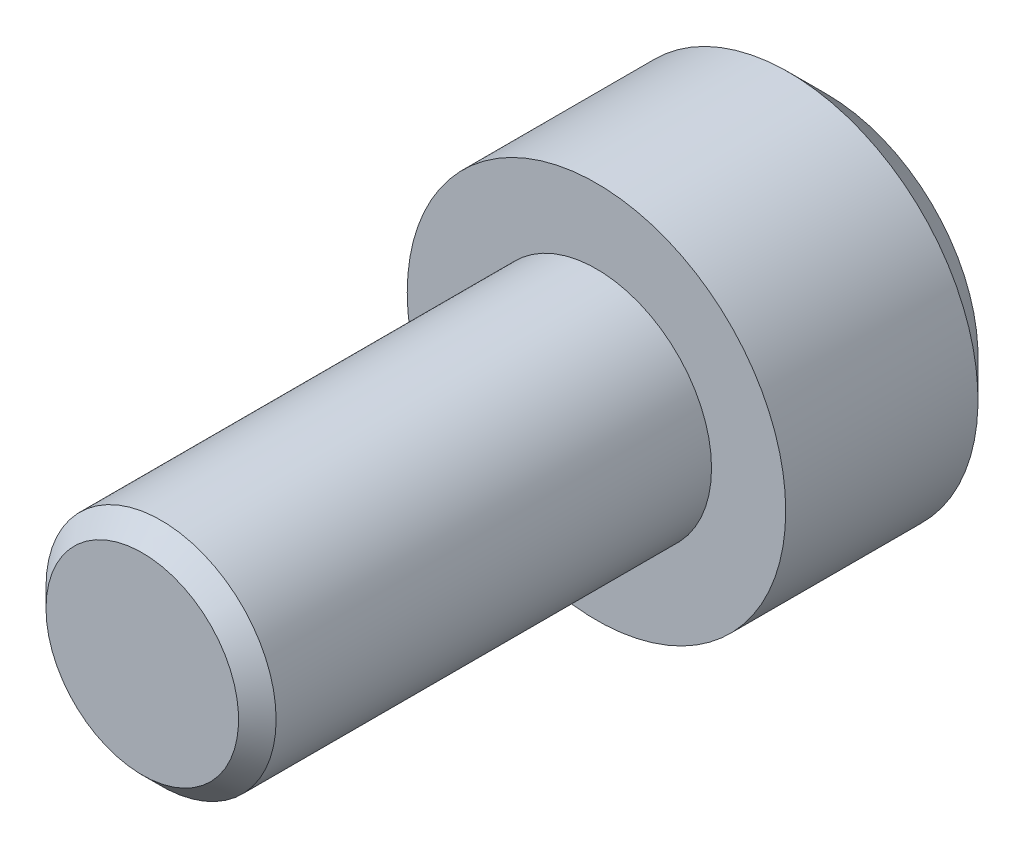
ISO-10303-21;
HEADER;
FILE_DESCRIPTION(('STEP AP214'),'2;1');
FILE_NAME('part.step','',(''),(''),'','','');
FILE_SCHEMA(('AUTOMOTIVE_DESIGN { 1 0 10303 214 1 1 1 1 }'));
ENDSEC;
DATA;
#1=APPLICATION_CONTEXT('core data for automotive mechanical design processes');
#2=APPLICATION_PROTOCOL_DEFINITION('international standard','automotive_design',2000,#1);
#3=PRODUCT_CONTEXT('',#1,'mechanical');
#4=PRODUCT('Part','Part','',(#3));
#5=PRODUCT_RELATED_PRODUCT_CATEGORY('part','',(#4));
#6=PRODUCT_DEFINITION_FORMATION('','',#4);
#7=PRODUCT_DEFINITION_CONTEXT('part definition',#1,'design');
#8=PRODUCT_DEFINITION('design','',#6,#7);
#9=PRODUCT_DEFINITION_SHAPE('','',#8);
#10=(LENGTH_UNIT() NAMED_UNIT(*) SI_UNIT(.MILLI.,.METRE.));
#11=(NAMED_UNIT(*) PLANE_ANGLE_UNIT() SI_UNIT($,.RADIAN.));
#12=(NAMED_UNIT(*) SI_UNIT($,.STERADIAN.) SOLID_ANGLE_UNIT());
#13=UNCERTAINTY_MEASURE_WITH_UNIT(LENGTH_MEASURE(1.E-05),#10,'distance_accuracy_value','');
#14=(GEOMETRIC_REPRESENTATION_CONTEXT(3) GLOBAL_UNCERTAINTY_ASSIGNED_CONTEXT((#13)) GLOBAL_UNIT_ASSIGNED_CONTEXT((#10,
#11,#12)) REPRESENTATION_CONTEXT('',''));
#15=CARTESIAN_POINT('',(0.,0.,0.));
#16=DIRECTION('',(0.,0.,1.));
#17=DIRECTION('',(1.,0.,0.));
#18=AXIS2_PLACEMENT_3D('',#15,#16,#17);
#19=CARTESIAN_POINT('',(75.6412,46.355,-54.2417));
#20=DIRECTION('',(0.,0.,1.));
#21=DIRECTION('',(1.,0.,0.));
#22=AXIS2_PLACEMENT_3D('',#19,#20,#21);
#23=PLANE('',#22);
#24=DIRECTION('',(0.991496436705714,-0.13013383879634,0.));
#25=VECTOR('',#24,1.);
#26=CARTESIAN_POINT('',(75.3829656636386,44.3874992584122,-54.2417));
#27=LINE('',#26,#25);
#28=CARTESIAN_POINT('',(76.5189027464251,44.2384075947999,-54.2417));
#29=VERTEX_POINT('',#28);
#30=CARTESIAN_POINT('',(74.2470285808521,44.5365909220244,-54.2417));
#31=VERTEX_POINT('',#30);
#32=EDGE_CURVE('E126',#29,#31,#27,.F.);
#33=ORIENTED_EDGE('',*,*,#32,.T.);
#34=DIRECTION('',(0.383049008063238,-0.923728021347068,0.));
#35=VECTOR('',#34,1.);
#36=CARTESIAN_POINT('',(73.8081772076394,45.5948871246245,-54.2417));
#37=LINE('',#36,#35);
#38=CARTESIAN_POINT('',(73.369325834427,46.6531833272246,-54.2417));
#39=VERTEX_POINT('',#38);
#40=EDGE_CURVE('E130',#31,#39,#37,.F.);
#41=ORIENTED_EDGE('',*,*,#40,.T.);
#42=DIRECTION('',(-0.608447428642477,-0.793594182550728,0.));
#43=VECTOR('',#42,1.);
#44=CARTESIAN_POINT('',(74.066411544001,47.5623878662123,-54.2417));
#45=LINE('',#44,#43);
#46=CARTESIAN_POINT('',(74.7634972535751,48.4715924052001,-54.2417));
#47=VERTEX_POINT('',#46);
#48=EDGE_CURVE('E134',#39,#47,#45,.F.);
#49=ORIENTED_EDGE('',*,*,#48,.T.);
#50=DIRECTION('',(-0.991496436705714,0.13013383879634,0.));
#51=VECTOR('',#50,1.);
#52=CARTESIAN_POINT('',(75.8994343363616,48.3225007415878,-54.2417));
#53=LINE('',#52,#51);
#54=CARTESIAN_POINT('',(77.0353714191481,48.1734090779755,-54.2417));
#55=VERTEX_POINT('',#54);
#56=EDGE_CURVE('E67',#47,#55,#53,.F.);
#57=ORIENTED_EDGE('',*,*,#56,.T.);
#58=DIRECTION('',(-0.383049008063237,0.923728021347068,0.));
#59=VECTOR('',#58,1.);
#60=CARTESIAN_POINT('',(77.4742227923606,47.1151128753755,-54.2417));
#61=LINE('',#60,#59);
#62=CARTESIAN_POINT('',(77.9130741655732,46.0568166727754,-54.2417));
#63=VERTEX_POINT('',#62);
#64=EDGE_CURVE('E69',#55,#63,#61,.F.);
#65=ORIENTED_EDGE('',*,*,#64,.T.);
#66=DIRECTION('',(0.608447428642477,0.793594182550728,0.));
#67=VECTOR('',#66,1.);
#68=CARTESIAN_POINT('',(77.2159884559992,45.1476121337877,-54.2417));
#69=LINE('',#68,#67);
#70=EDGE_CURVE('E71',#63,#29,#69,.F.);
#71=ORIENTED_EDGE('',*,*,#70,.T.);
#72=EDGE_LOOP('',(#33,#41,#49,#57,#65,#71));
#73=FACE_BOUND('',#72,.T.);
#74=ADVANCED_FACE('F16',(#73),#23,.F.);
#75=CARTESIAN_POINT('',(77.2159884559992,45.1476121337877,-55.3847));
#76=DIRECTION('',(0.793594182550728,-0.608447428642477,0.));
#77=DIRECTION('',(0.608447428642477,0.793594182550728,0.));
#78=AXIS2_PLACEMENT_3D('',#75,#76,#77);
#79=PLANE('',#78);
#80=DIRECTION('',(0.608447428642508,0.793594182550704,0.));
#81=VECTOR('',#80,1.);
#82=CARTESIAN_POINT('',(76.5189027464251,44.2384075947999,-56.5277));
#83=LINE('',#82,#81);
#84=CARTESIAN_POINT('',(76.5189027464251,44.2384075947999,-56.5277));
#85=VERTEX_POINT('',#84);
#86=CARTESIAN_POINT('',(77.9130741655732,46.0568166727754,-56.5277));
#87=VERTEX_POINT('',#86);
#88=EDGE_CURVE('E122',#85,#87,#83,.T.);
#89=ORIENTED_EDGE('',*,*,#88,.F.);
#90=DIRECTION('',(0.,0.,1.));
#91=VECTOR('',#90,1.);
#92=CARTESIAN_POINT('',(76.5189027464251,44.2384075947999,-55.3847));
#93=LINE('',#92,#91);
#94=EDGE_CURVE('E82',#85,#29,#93,.T.);
#95=ORIENTED_EDGE('',*,*,#94,.T.);
#96=ORIENTED_EDGE('',*,*,#70,.F.);
#97=DIRECTION('',(0.,0.,1.));
#98=VECTOR('',#97,1.);
#99=CARTESIAN_POINT('',(77.9130741655732,46.0568166727753,-55.3847));
#100=LINE('',#99,#98);
#101=EDGE_CURVE('E76',#63,#87,#100,.F.);
#102=ORIENTED_EDGE('',*,*,#101,.T.);
#103=EDGE_LOOP('',(#89,#95,#96,#102));
#104=FACE_BOUND('',#103,.T.);
#105=ADVANCED_FACE('F79',(#104),#79,.F.);
#106=CARTESIAN_POINT('',(77.4742227923606,47.1151128753755,-55.3847));
#107=DIRECTION('',(0.923728021347068,0.383049008063237,0.));
#108=DIRECTION('',(-0.383049008063237,0.923728021347068,0.));
#109=AXIS2_PLACEMENT_3D('',#106,#107,#108);
#110=PLANE('',#109);
#111=DIRECTION('',(-0.383049008063222,0.923728021347075,0.));
#112=VECTOR('',#111,1.);
#113=CARTESIAN_POINT('',(77.9130741655732,46.0568166727753,-56.5277));
#114=LINE('',#113,#112);
#115=CARTESIAN_POINT('',(77.0353714191481,48.1734090779755,-56.5277));
#116=VERTEX_POINT('',#115);
#117=EDGE_CURVE('E87',#87,#116,#114,.T.);
#118=ORIENTED_EDGE('',*,*,#117,.F.);
#119=ORIENTED_EDGE('',*,*,#101,.F.);
#120=ORIENTED_EDGE('',*,*,#64,.F.);
#121=DIRECTION('',(0.,0.,1.));
#122=VECTOR('',#121,1.);
#123=CARTESIAN_POINT('',(77.0353714191481,48.1734090779755,-55.3847));
#124=LINE('',#123,#122);
#125=EDGE_CURVE('E90',#55,#116,#124,.F.);
#126=ORIENTED_EDGE('',*,*,#125,.T.);
#127=EDGE_LOOP('',(#118,#119,#120,#126));
#128=FACE_BOUND('',#127,.T.);
#129=ADVANCED_FACE('F85',(#128),#110,.F.);
#130=CARTESIAN_POINT('',(75.8994343363616,48.3225007415878,-55.3847));
#131=DIRECTION('',(0.13013383879634,0.991496436705714,0.));
#132=DIRECTION('',(-0.991496436705714,0.13013383879634,0.));
#133=AXIS2_PLACEMENT_3D('',#130,#131,#132);
#134=PLANE('',#133);
#135=DIRECTION('',(-0.991496436705716,0.130133838796329,0.));
#136=VECTOR('',#135,1.);
#137=CARTESIAN_POINT('',(77.0353714191481,48.1734090779756,-56.5277));
#138=LINE('',#137,#136);
#139=CARTESIAN_POINT('',(74.7634972535751,48.4715924052001,-56.5277));
#140=VERTEX_POINT('',#139);
#141=EDGE_CURVE('E118',#116,#140,#138,.T.);
#142=ORIENTED_EDGE('',*,*,#141,.F.);
#143=ORIENTED_EDGE('',*,*,#125,.F.);
#144=ORIENTED_EDGE('',*,*,#56,.F.);
#145=DIRECTION('',(0.,0.,1.));
#146=VECTOR('',#145,1.);
#147=CARTESIAN_POINT('',(74.7634972535751,48.4715924052002,-55.3847));
#148=LINE('',#147,#146);
#149=EDGE_CURVE('E132',#47,#140,#148,.F.);
#150=ORIENTED_EDGE('',*,*,#149,.T.);
#151=EDGE_LOOP('',(#142,#143,#144,#150));
#152=FACE_BOUND('',#151,.T.);
#153=ADVANCED_FACE('F137',(#152),#134,.F.);
#154=CARTESIAN_POINT('',(74.066411544001,47.5623878662123,-55.3847));
#155=DIRECTION('',(-0.793594182550728,0.608447428642477,0.));
#156=DIRECTION('',(-0.608447428642477,-0.793594182550728,0.));
#157=AXIS2_PLACEMENT_3D('',#154,#155,#156);
#158=PLANE('',#157);
#159=DIRECTION('',(-0.608447428642508,-0.793594182550704,0.));
#160=VECTOR('',#159,1.);
#161=CARTESIAN_POINT('',(74.7634972535751,48.4715924052002,-56.5277));
#162=LINE('',#161,#160);
#163=CARTESIAN_POINT('',(73.369325834427,46.6531833272246,-56.5277));
#164=VERTEX_POINT('',#163);
#165=EDGE_CURVE('E115',#140,#164,#162,.T.);
#166=ORIENTED_EDGE('',*,*,#165,.F.);
#167=ORIENTED_EDGE('',*,*,#149,.F.);
#168=ORIENTED_EDGE('',*,*,#48,.F.);
#169=DIRECTION('',(0.,0.,1.));
#170=VECTOR('',#169,1.);
#171=CARTESIAN_POINT('',(73.3693258344269,46.6531833272246,-55.3847));
#172=LINE('',#171,#170);
#173=EDGE_CURVE('E128',#39,#164,#172,.F.);
#174=ORIENTED_EDGE('',*,*,#173,.T.);
#175=EDGE_LOOP('',(#166,#167,#168,#174));
#176=FACE_BOUND('',#175,.T.);
#177=ADVANCED_FACE('F149',(#176),#158,.F.);
#178=CARTESIAN_POINT('',(73.8081772076394,45.5948871246245,-55.3847));
#179=DIRECTION('',(-0.923728021347068,-0.383049008063238,0.));
#180=DIRECTION('',(0.383049008063238,-0.923728021347068,0.));
#181=AXIS2_PLACEMENT_3D('',#178,#179,#180);
#182=PLANE('',#181);
#183=DIRECTION('',(0.383049008063211,-0.923728021347079,0.));
#184=VECTOR('',#183,1.);
#185=CARTESIAN_POINT('',(73.369325834427,46.6531833272247,-56.5277));
#186=LINE('',#185,#184);
#187=CARTESIAN_POINT('',(74.247028580852,44.5365909220244,-56.5277));
#188=VERTEX_POINT('',#187);
#189=EDGE_CURVE('E112',#164,#188,#186,.T.);
#190=ORIENTED_EDGE('',*,*,#189,.F.);
#191=ORIENTED_EDGE('',*,*,#173,.F.);
#192=ORIENTED_EDGE('',*,*,#40,.F.);
#193=DIRECTION('',(0.,0.,1.));
#194=VECTOR('',#193,1.);
#195=CARTESIAN_POINT('',(74.2470285808521,44.5365909220245,-55.3847));
#196=LINE('',#195,#194);
#197=EDGE_CURVE('E34',#31,#188,#196,.F.);
#198=ORIENTED_EDGE('',*,*,#197,.T.);
#199=EDGE_LOOP('',(#190,#191,#192,#198));
#200=FACE_BOUND('',#199,.T.);
#201=ADVANCED_FACE('F147',(#200),#182,.F.);
#202=CARTESIAN_POINT('',(75.3829656636386,44.3874992584122,-55.3847));
#203=DIRECTION('',(-0.13013383879634,-0.991496436705714,0.));
#204=DIRECTION('',(0.991496436705714,-0.13013383879634,0.));
#205=AXIS2_PLACEMENT_3D('',#202,#203,#204);
#206=PLANE('',#205);
#207=DIRECTION('',(0.991496436705721,-0.130133838796285,0.));
#208=VECTOR('',#207,1.);
#209=CARTESIAN_POINT('',(74.2470285808521,44.5365909220243,-56.5277));
#210=LINE('',#209,#208);
#211=EDGE_CURVE('E108',#188,#85,#210,.T.);
#212=ORIENTED_EDGE('',*,*,#211,.F.);
#213=ORIENTED_EDGE('',*,*,#197,.F.);
#214=ORIENTED_EDGE('',*,*,#32,.F.);
#215=ORIENTED_EDGE('',*,*,#94,.F.);
#216=EDGE_LOOP('',(#212,#213,#214,#215));
#217=FACE_BOUND('',#216,.T.);
#218=ADVANCED_FACE('F144',(#217),#206,.F.);
#219=CARTESIAN_POINT('',(75.6412,46.355,-56.5277));
#220=DIRECTION('',(0.,0.,-1.));
#221=DIRECTION('',(-1.,0.,0.));
#222=AXIS2_PLACEMENT_3D('',#219,#220,#221);
#223=PLANE('',#222);
#224=ORIENTED_EDGE('',*,*,#189,.T.);
#225=ORIENTED_EDGE('',*,*,#211,.T.);
#226=ORIENTED_EDGE('',*,*,#88,.T.);
#227=ORIENTED_EDGE('',*,*,#117,.T.);
#228=ORIENTED_EDGE('',*,*,#141,.T.);
#229=ORIENTED_EDGE('',*,*,#165,.T.);
#230=EDGE_LOOP('',(#224,#225,#226,#227,#228,#229));
#231=FACE_BOUND('',#230,.T.);
#232=CARTESIAN_POINT('',(75.6412,46.355,-56.5277000007427));
#233=DIRECTION('',(0.,0.,1.));
#234=DIRECTION('',(0.,-1.,0.));
#235=AXIS2_PLACEMENT_3D('',#232,#233,#234);
#236=CIRCLE('',#235,3.17500000074461);
#237=CARTESIAN_POINT('',(75.6412,43.1799999992554,-56.5277000007427));
#238=VERTEX_POINT('',#237);
#239=EDGE_CURVE('E19',#238,#238,#236,.T.);
#240=ORIENTED_EDGE('',*,*,#239,.F.);
#241=EDGE_LOOP('',(#240));
#242=FACE_BOUND('',#241,.T.);
#243=ADVANCED_FACE('F141',(#231,#242),#223,.T.);
#244=CARTESIAN_POINT('',(75.6412,46.355,-55.7339500001035));
#245=DIRECTION('',(0.,0.,1.));
#246=DIRECTION('',(0.,-1.,0.));
#247=AXIS2_PLACEMENT_3D('',#244,#245,#246);
#248=CONICAL_SURFACE('',#247,3.96874999990587,0.785398162466469);
#249=CARTESIAN_POINT('',(75.6412,46.355,-55.73395));
#250=DIRECTION('',(0.,0.,-1.));
#251=DIRECTION('',(-1.,0.,0.));
#252=AXIS2_PLACEMENT_3D('',#249,#250,#251);
#253=CIRCLE('',#252,3.96875000000001);
#254=CARTESIAN_POINT('',(71.67245,46.355,-55.73395));
#255=VERTEX_POINT('',#254);
#256=EDGE_CURVE('E100',#255,#255,#253,.F.);
#257=ORIENTED_EDGE('',*,*,#256,.F.);
#258=EDGE_LOOP('',(#257));
#259=FACE_BOUND('',#258,.T.);
#260=ORIENTED_EDGE('',*,*,#239,.T.);
#261=EDGE_LOOP('',(#260));
#262=FACE_BOUND('',#261,.T.);
#263=ADVANCED_FACE('F181',(#259,#262),#248,.T.);
#264=CARTESIAN_POINT('',(75.6412,46.355,-51.7017));
#265=DIRECTION('',(0.,0.,-1.));
#266=DIRECTION('',(-1.,0.,0.));
#267=AXIS2_PLACEMENT_3D('',#264,#265,#266);
#268=CYLINDRICAL_SURFACE('',#267,3.96875000000001);
#269=ORIENTED_EDGE('',*,*,#256,.T.);
#270=EDGE_LOOP('',(#269));
#271=FACE_BOUND('',#270,.T.);
#272=CARTESIAN_POINT('',(75.6412,46.355,-51.7017));
#273=DIRECTION('',(0.,0.,-1.));
#274=DIRECTION('',(-1.,0.,0.));
#275=AXIS2_PLACEMENT_3D('',#272,#273,#274);
#276=CIRCLE('',#275,3.96875000000001);
#277=CARTESIAN_POINT('',(71.67245,46.355,-51.7017));
#278=VERTEX_POINT('',#277);
#279=EDGE_CURVE('E98',#278,#278,#276,.F.);
#280=ORIENTED_EDGE('',*,*,#279,.F.);
#281=EDGE_LOOP('',(#280));
#282=FACE_BOUND('',#281,.T.);
#283=ADVANCED_FACE('F177',(#271,#282),#268,.T.);
#284=CARTESIAN_POINT('',(75.6412,46.355,-42.1767));
#285=DIRECTION('',(0.,0.,1.));
#286=DIRECTION('',(1.,0.,0.));
#287=AXIS2_PLACEMENT_3D('',#284,#285,#286);
#288=PLANE('',#287);
#289=CARTESIAN_POINT('',(75.6412,46.355,-42.1767000000909));
#290=DIRECTION('',(0.,0.,-1.));
#291=DIRECTION('',(-1.,0.,0.));
#292=AXIS2_PLACEMENT_3D('',#289,#290,#291);
#293=CIRCLE('',#292,2.01929999957429);
#294=CARTESIAN_POINT('',(73.6219000004257,46.355,-42.1767000000909));
#295=VERTEX_POINT('',#294);
#296=EDGE_CURVE('E96',#295,#295,#293,.T.);
#297=ORIENTED_EDGE('',*,*,#296,.F.);
#298=EDGE_LOOP('',(#297));
#299=FACE_BOUND('',#298,.T.);
#300=ADVANCED_FACE('F174',(#299),#288,.T.);
#301=CARTESIAN_POINT('',(75.6412,46.355,-51.7017));
#302=DIRECTION('',(0.,0.,1.));
#303=DIRECTION('',(1.,0.,0.));
#304=AXIS2_PLACEMENT_3D('',#301,#302,#303);
#305=PLANE('',#304);
#306=ORIENTED_EDGE('',*,*,#279,.T.);
#307=EDGE_LOOP('',(#306));
#308=FACE_BOUND('',#307,.T.);
#309=CARTESIAN_POINT('',(75.6412,46.355,-51.7017));
#310=DIRECTION('',(0.,0.,1.));
#311=DIRECTION('',(1.,0.,0.));
#312=AXIS2_PLACEMENT_3D('',#309,#310,#311);
#313=CIRCLE('',#312,2.413);
#314=CARTESIAN_POINT('',(78.0542,46.355,-51.7017));
#315=VERTEX_POINT('',#314);
#316=EDGE_CURVE('E25',#315,#315,#313,.T.);
#317=ORIENTED_EDGE('',*,*,#316,.F.);
#318=EDGE_LOOP('',(#317));
#319=FACE_BOUND('',#318,.T.);
#320=ADVANCED_FACE('F167',(#308,#319),#305,.T.);
#321=CARTESIAN_POINT('',(75.6412,46.355,-42.5703999996472));
#322=DIRECTION('',(0.,0.,-1.));
#323=DIRECTION('',(-1.,0.,0.));
#324=AXIS2_PLACEMENT_3D('',#321,#322,#323);
#325=CONICAL_SURFACE('',#324,2.41299999992634,0.785398164408126);
#326=CARTESIAN_POINT('',(75.6412,46.355,-42.5703999996435));
#327=DIRECTION('',(0.,0.,1.));
#328=DIRECTION('',(1.,0.,0.));
#329=AXIS2_PLACEMENT_3D('',#326,#327,#328);
#330=CIRCLE('',#329,2.413);
#331=CARTESIAN_POINT('',(78.0542,46.355,-42.5703999996435));
#332=VERTEX_POINT('',#331);
#333=EDGE_CURVE('E11',#332,#332,#330,.F.);
#334=ORIENTED_EDGE('',*,*,#333,.F.);
#335=EDGE_LOOP('',(#334));
#336=FACE_BOUND('',#335,.T.);
#337=ORIENTED_EDGE('',*,*,#296,.T.);
#338=EDGE_LOOP('',(#337));
#339=FACE_BOUND('',#338,.T.);
#340=ADVANCED_FACE('F161',(#336,#339),#325,.T.);
#341=CARTESIAN_POINT('',(75.6412,46.355,-51.7017));
#342=DIRECTION('',(0.,0.,1.));
#343=DIRECTION('',(1.,0.,0.));
#344=AXIS2_PLACEMENT_3D('',#341,#342,#343);
#345=CYLINDRICAL_SURFACE('',#344,2.413);
#346=ORIENTED_EDGE('',*,*,#333,.T.);
#347=EDGE_LOOP('',(#346));
#348=FACE_BOUND('',#347,.T.);
#349=ORIENTED_EDGE('',*,*,#316,.T.);
#350=EDGE_LOOP('',(#349));
#351=FACE_BOUND('',#350,.T.);
#352=ADVANCED_FACE('F159',(#348,#351),#345,.T.);
#353=CLOSED_SHELL('',(#74,#105,#129,#153,#177,#201,#218,#243,#263,#283,#300,#320,#340,#352));
#354=MANIFOLD_SOLID_BREP('B1',#353);
#355=ADVANCED_BREP_SHAPE_REPRESENTATION('',(#18,#354),#14);
#356=SHAPE_DEFINITION_REPRESENTATION(#9,#355);
ENDSEC;
END-ISO-10303-21;
